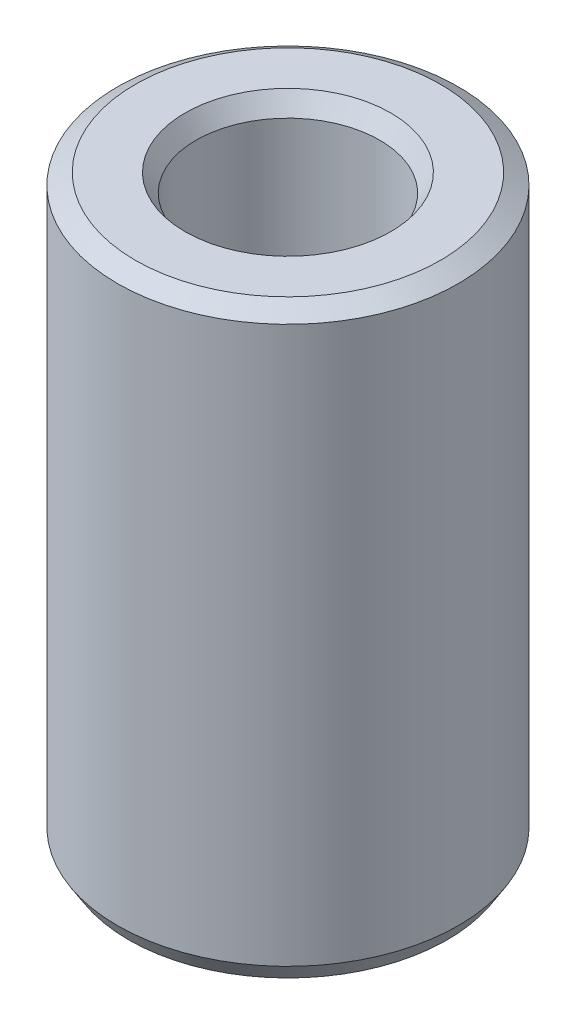
ISO-10303-21;
HEADER;
FILE_DESCRIPTION(('STEP AP214'),'2;1');
FILE_NAME('part.step','',(''),(''),'','','');
FILE_SCHEMA(('AUTOMOTIVE_DESIGN { 1 0 10303 214 1 1 1 1 }'));
ENDSEC;
DATA;
#1=APPLICATION_CONTEXT('core data for automotive mechanical design processes');
#2=APPLICATION_PROTOCOL_DEFINITION('international standard','automotive_design',2000,#1);
#3=PRODUCT_CONTEXT('',#1,'mechanical');
#4=PRODUCT('Part','Part','',(#3));
#5=PRODUCT_RELATED_PRODUCT_CATEGORY('part','',(#4));
#6=PRODUCT_DEFINITION_FORMATION('','',#4);
#7=PRODUCT_DEFINITION_CONTEXT('part definition',#1,'design');
#8=PRODUCT_DEFINITION('design','',#6,#7);
#9=PRODUCT_DEFINITION_SHAPE('','',#8);
#10=(LENGTH_UNIT() NAMED_UNIT(*) SI_UNIT(.MILLI.,.METRE.));
#11=(NAMED_UNIT(*) PLANE_ANGLE_UNIT() SI_UNIT($,.RADIAN.));
#12=(NAMED_UNIT(*) SI_UNIT($,.STERADIAN.) SOLID_ANGLE_UNIT());
#13=UNCERTAINTY_MEASURE_WITH_UNIT(LENGTH_MEASURE(1.E-05),#10,'distance_accuracy_value','');
#14=(GEOMETRIC_REPRESENTATION_CONTEXT(3) GLOBAL_UNCERTAINTY_ASSIGNED_CONTEXT((#13)) GLOBAL_UNIT_ASSIGNED_CONTEXT((#10,
#11,#12)) REPRESENTATION_CONTEXT('',''));
#15=CARTESIAN_POINT('',(0.,0.,0.));
#16=DIRECTION('',(0.,0.,1.));
#17=DIRECTION('',(1.,0.,0.));
#18=AXIS2_PLACEMENT_3D('',#15,#16,#17);
#19=CARTESIAN_POINT('',(0.,180.201495893202,0.));
#20=DIRECTION('',(0.,-1.,0.));
#21=DIRECTION('',(0.,0.,-1.));
#22=AXIS2_PLACEMENT_3D('',#19,#20,#21);
#23=CYLINDRICAL_SURFACE('',#22,52.5);
#24=CARTESIAN_POINT('',(0.,5.52573291041766,0.));
#25=DIRECTION('',(0.,1.,0.));
#26=DIRECTION('',(0.,0.,1.));
#27=AXIS2_PLACEMENT_3D('',#24,#25,#26);
#28=CIRCLE('',#27,52.5);
#29=CARTESIAN_POINT('',(0.,5.52573291041766,52.5));
#30=VERTEX_POINT('',#29);
#31=EDGE_CURVE('E10',#30,#30,#28,.T.);
#32=ORIENTED_EDGE('',*,*,#31,.T.);
#33=EDGE_LOOP('',(#32));
#34=FACE_BOUND('',#33,.T.);
#35=CARTESIAN_POINT('',(0.,176.771727975163,0.));
#36=DIRECTION('',(0.,1.,0.));
#37=DIRECTION('',(0.,0.,1.));
#38=AXIS2_PLACEMENT_3D('',#35,#36,#37);
#39=CIRCLE('',#38,52.5);
#40=CARTESIAN_POINT('',(0.,176.771727975163,52.5));
#41=VERTEX_POINT('',#40);
#42=EDGE_CURVE('E50',#41,#41,#39,.F.);
#43=ORIENTED_EDGE('',*,*,#42,.T.);
#44=EDGE_LOOP('',(#43));
#45=FACE_BOUND('',#44,.T.);
#46=ADVANCED_FACE('F39',(#34,#45),#23,.T.);
#47=CARTESIAN_POINT('',(0.,180.201495893202,0.));
#48=DIRECTION('',(0.,1.,0.));
#49=DIRECTION('',(0.,0.,1.));
#50=AXIS2_PLACEMENT_3D('',#47,#48,#49);
#51=PLANE('',#50);
#52=CARTESIAN_POINT('',(0.,180.201495893202,0.));
#53=DIRECTION('',(0.,1.,0.));
#54=DIRECTION('',(0.,0.,1.));
#55=AXIS2_PLACEMENT_3D('',#52,#53,#54);
#56=CIRCLE('',#55,31.683987075075);
#57=CARTESIAN_POINT('',(0.,180.201495893202,31.683987075075));
#58=VERTEX_POINT('',#57);
#59=EDGE_CURVE('E58',#58,#58,#56,.F.);
#60=ORIENTED_EDGE('',*,*,#59,.T.);
#61=EDGE_LOOP('',(#60));
#62=FACE_BOUND('',#61,.T.);
#63=CARTESIAN_POINT('',(0.,180.201495893202,0.));
#64=DIRECTION('',(0.,1.,0.));
#65=DIRECTION('',(0.,0.,1.));
#66=AXIS2_PLACEMENT_3D('',#63,#64,#65);
#67=CIRCLE('',#66,46.9742670895824);
#68=CARTESIAN_POINT('',(0.,180.201495893202,46.9742670895824));
#69=VERTEX_POINT('',#68);
#70=EDGE_CURVE('E61',#69,#69,#67,.T.);
#71=ORIENTED_EDGE('',*,*,#70,.T.);
#72=EDGE_LOOP('',(#71));
#73=FACE_BOUND('',#72,.T.);
#74=ADVANCED_FACE('F88',(#62,#73),#51,.T.);
#75=CARTESIAN_POINT('',(0.,0.,0.));
#76=DIRECTION('',(0.,1.,0.));
#77=DIRECTION('',(0.,0.,1.));
#78=AXIS2_PLACEMENT_3D('',#75,#76,#77);
#79=PLANE('',#78);
#80=CARTESIAN_POINT('',(0.,0.,0.));
#81=DIRECTION('',(0.,1.,0.));
#82=DIRECTION('',(0.,0.,1.));
#83=AXIS2_PLACEMENT_3D('',#80,#81,#82);
#84=CIRCLE('',#83,33.7799520674539);
#85=CARTESIAN_POINT('',(0.,0.,33.7799520674539));
#86=VERTEX_POINT('',#85);
#87=EDGE_CURVE('E51',#86,#86,#84,.T.);
#88=ORIENTED_EDGE('',*,*,#87,.T.);
#89=EDGE_LOOP('',(#88));
#90=FACE_BOUND('',#89,.T.);
#91=CARTESIAN_POINT('',(0.,0.,0.));
#92=DIRECTION('',(0.,1.,0.));
#93=DIRECTION('',(0.,0.,1.));
#94=AXIS2_PLACEMENT_3D('',#91,#92,#93);
#95=CIRCLE('',#94,49.0702320819612);
#96=CARTESIAN_POINT('',(0.,0.,49.0702320819612));
#97=VERTEX_POINT('',#96);
#98=EDGE_CURVE('E54',#97,#97,#95,.F.);
#99=ORIENTED_EDGE('',*,*,#98,.T.);
#100=EDGE_LOOP('',(#99));
#101=FACE_BOUND('',#100,.T.);
#102=ADVANCED_FACE('F83',(#90,#101),#79,.F.);
#103=CARTESIAN_POINT('',(0.,180.201495893202,0.));
#104=DIRECTION('',(0.,-1.,0.));
#105=DIRECTION('',(0.,0.,-1.));
#106=AXIS2_PLACEMENT_3D('',#103,#104,#105);
#107=CYLINDRICAL_SURFACE('',#106,28.2542191570363);
#108=CARTESIAN_POINT('',(0.,174.675762982784,0.));
#109=DIRECTION('',(0.,1.,0.));
#110=DIRECTION('',(0.,0.,1.));
#111=AXIS2_PLACEMENT_3D('',#108,#109,#110);
#112=CIRCLE('',#111,28.2542191570363);
#113=CARTESIAN_POINT('',(0.,174.675762982784,28.2542191570363));
#114=VERTEX_POINT('',#113);
#115=EDGE_CURVE('E67',#114,#114,#112,.T.);
#116=ORIENTED_EDGE('',*,*,#115,.T.);
#117=EDGE_LOOP('',(#116));
#118=FACE_BOUND('',#117,.T.);
#119=CARTESIAN_POINT('',(0.,3.4297679180387,0.));
#120=DIRECTION('',(0.,1.,0.));
#121=DIRECTION('',(0.,0.,1.));
#122=AXIS2_PLACEMENT_3D('',#119,#120,#121);
#123=CIRCLE('',#122,28.2542191570363);
#124=CARTESIAN_POINT('',(0.,3.4297679180387,28.2542191570363));
#125=VERTEX_POINT('',#124);
#126=EDGE_CURVE('E69',#125,#125,#123,.F.);
#127=ORIENTED_EDGE('',*,*,#126,.T.);
#128=EDGE_LOOP('',(#127));
#129=FACE_BOUND('',#128,.T.);
#130=ADVANCED_FACE('F71',(#118,#129),#107,.F.);
#131=CARTESIAN_POINT('',(0.,174.675762982784,0.));
#132=DIRECTION('',(0.,1.,0.));
#133=DIRECTION('',(0.,0.,1.));
#134=AXIS2_PLACEMENT_3D('',#131,#132,#133);
#135=CONICAL_SURFACE('',#134,28.2542191570363,0.555494083201766);
#136=ORIENTED_EDGE('',*,*,#59,.F.);
#137=EDGE_LOOP('',(#136));
#138=FACE_BOUND('',#137,.T.);
#139=ORIENTED_EDGE('',*,*,#115,.F.);
#140=EDGE_LOOP('',(#139));
#141=FACE_BOUND('',#140,.T.);
#142=ADVANCED_FACE('F77',(#138,#141),#135,.F.);
#143=CARTESIAN_POINT('',(0.,0.,0.));
#144=DIRECTION('',(0.,-1.,0.));
#145=DIRECTION('',(0.,0.,-1.));
#146=AXIS2_PLACEMENT_3D('',#143,#144,#145);
#147=CONICAL_SURFACE('',#146,33.7799520674539,1.01530224359313);
#148=ORIENTED_EDGE('',*,*,#126,.F.);
#149=EDGE_LOOP('',(#148));
#150=FACE_BOUND('',#149,.T.);
#151=ORIENTED_EDGE('',*,*,#87,.F.);
#152=EDGE_LOOP('',(#151));
#153=FACE_BOUND('',#152,.T.);
#154=ADVANCED_FACE('F73',(#150,#153),#147,.F.);
#155=CARTESIAN_POINT('',(0.,5.52573291041766,0.));
#156=DIRECTION('',(0.,1.,0.));
#157=DIRECTION('',(0.,0.,1.));
#158=AXIS2_PLACEMENT_3D('',#155,#156,#157);
#159=CONICAL_SURFACE('',#158,52.5,0.55549408320177);
#160=ORIENTED_EDGE('',*,*,#98,.F.);
#161=EDGE_LOOP('',(#160));
#162=FACE_BOUND('',#161,.T.);
#163=ORIENTED_EDGE('',*,*,#31,.F.);
#164=EDGE_LOOP('',(#163));
#165=FACE_BOUND('',#164,.T.);
#166=ADVANCED_FACE('F76',(#162,#165),#159,.T.);
#167=CARTESIAN_POINT('',(0.,180.201495893202,0.));
#168=DIRECTION('',(0.,-1.,0.));
#169=DIRECTION('',(0.,0.,-1.));
#170=AXIS2_PLACEMENT_3D('',#167,#168,#169);
#171=CONICAL_SURFACE('',#170,46.9742670895824,1.01530224359313);
#172=ORIENTED_EDGE('',*,*,#42,.F.);
#173=EDGE_LOOP('',(#172));
#174=FACE_BOUND('',#173,.T.);
#175=ORIENTED_EDGE('',*,*,#70,.F.);
#176=EDGE_LOOP('',(#175));
#177=FACE_BOUND('',#176,.T.);
#178=ADVANCED_FACE('F45',(#174,#177),#171,.T.);
#179=CLOSED_SHELL('',(#46,#74,#102,#130,#142,#154,#166,#178));
#180=MANIFOLD_SOLID_BREP('B2',#179);
#181=ADVANCED_BREP_SHAPE_REPRESENTATION('',(#18,#180),#14);
#182=SHAPE_DEFINITION_REPRESENTATION(#9,#181);
ENDSEC;
END-ISO-10303-21;
